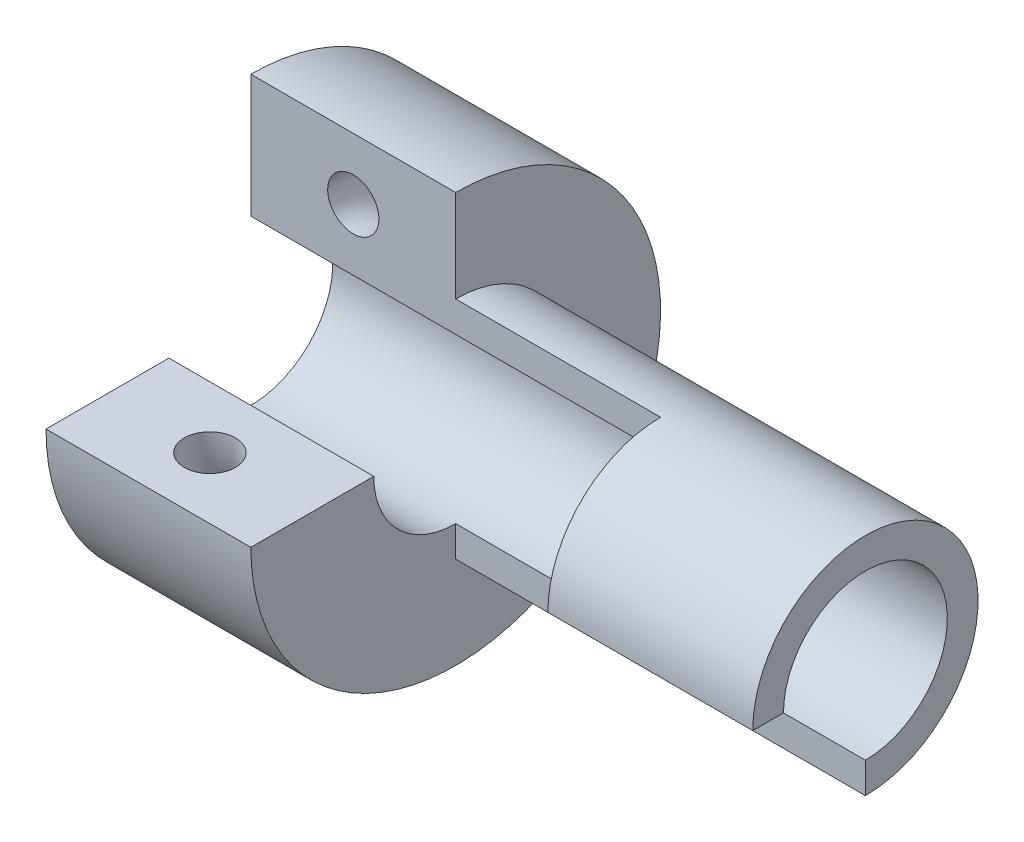
ISO-10303-21;
HEADER;
FILE_DESCRIPTION(('STEP AP214'),'2;1');
FILE_NAME('part.step','',(''),(''),'','','');
FILE_SCHEMA(('AUTOMOTIVE_DESIGN { 1 0 10303 214 1 1 1 1 }'));
ENDSEC;
DATA;
#1=APPLICATION_CONTEXT('core data for automotive mechanical design processes');
#2=APPLICATION_PROTOCOL_DEFINITION('international standard','automotive_design',2000,#1);
#3=PRODUCT_CONTEXT('',#1,'mechanical');
#4=PRODUCT('Part','Part','',(#3));
#5=PRODUCT_RELATED_PRODUCT_CATEGORY('part','',(#4));
#6=PRODUCT_DEFINITION_FORMATION('','',#4);
#7=PRODUCT_DEFINITION_CONTEXT('part definition',#1,'design');
#8=PRODUCT_DEFINITION('design','',#6,#7);
#9=PRODUCT_DEFINITION_SHAPE('','',#8);
#10=(LENGTH_UNIT() NAMED_UNIT(*) SI_UNIT(.MILLI.,.METRE.));
#11=(NAMED_UNIT(*) PLANE_ANGLE_UNIT() SI_UNIT($,.RADIAN.));
#12=(NAMED_UNIT(*) SI_UNIT($,.STERADIAN.) SOLID_ANGLE_UNIT());
#13=UNCERTAINTY_MEASURE_WITH_UNIT(LENGTH_MEASURE(1.E-05),#10,'distance_accuracy_value','');
#14=(GEOMETRIC_REPRESENTATION_CONTEXT(3) GLOBAL_UNCERTAINTY_ASSIGNED_CONTEXT((#13)) GLOBAL_UNIT_ASSIGNED_CONTEXT((#10,
#11,#12)) REPRESENTATION_CONTEXT('',''));
#15=CARTESIAN_POINT('',(0.,0.,0.));
#16=DIRECTION('',(0.,0.,1.));
#17=DIRECTION('',(1.,0.,0.));
#18=AXIS2_PLACEMENT_3D('',#15,#16,#17);
#19=CARTESIAN_POINT('',(0.,20.,-19.9999999999998));
#20=DIRECTION('',(0.,0.,-1.));
#21=DIRECTION('',(0.,1.,0.));
#22=AXIS2_PLACEMENT_3D('',#19,#20,#21);
#23=PLANE('',#22);
#24=CARTESIAN_POINT('',(10.,14.,-19.9999999999996));
#25=DIRECTION('',(0.,0.,-1.));
#26=DIRECTION('',(0.,1.,0.));
#27=AXIS2_PLACEMENT_3D('',#24,#25,#26);
#28=CIRCLE('',#27,2.5);
#29=CARTESIAN_POINT('',(10.,16.5,-19.9999999999995));
#30=VERTEX_POINT('',#29);
#31=EDGE_CURVE('E140',#30,#30,#28,.T.);
#32=ORIENTED_EDGE('',*,*,#31,.T.);
#33=EDGE_LOOP('',(#32));
#34=FACE_BOUND('',#33,.T.);
#35=DIRECTION('',(0.,-1.,0.));
#36=VECTOR('',#35,1.);
#37=CARTESIAN_POINT('',(40.,11.,-20.));
#38=LINE('',#37,#36);
#39=CARTESIAN_POINT('',(40.,11.,-20.));
#40=VERTEX_POINT('',#39);
#41=CARTESIAN_POINT('',(40.,8.,-20.));
#42=VERTEX_POINT('',#41);
#43=EDGE_CURVE('E114',#40,#42,#38,.T.);
#44=ORIENTED_EDGE('',*,*,#43,.F.);
#45=DIRECTION('',(-1.,0.,0.));
#46=VECTOR('',#45,1.);
#47=CARTESIAN_POINT('',(60.,11.,-19.9999999999998));
#48=LINE('',#47,#46);
#49=CARTESIAN_POINT('',(20.,11.,-19.9999999999999));
#50=VERTEX_POINT('',#49);
#51=EDGE_CURVE('E63',#40,#50,#48,.T.);
#52=ORIENTED_EDGE('',*,*,#51,.T.);
#53=DIRECTION('',(0.,-1.,0.));
#54=VECTOR('',#53,1.);
#55=CARTESIAN_POINT('',(20.,20.,-19.9999999999998));
#56=LINE('',#55,#54);
#57=CARTESIAN_POINT('',(20.,20.,-19.9999999999998));
#58=VERTEX_POINT('',#57);
#59=EDGE_CURVE('E176',#58,#50,#56,.T.);
#60=ORIENTED_EDGE('',*,*,#59,.F.);
#61=DIRECTION('',(1.,0.,0.));
#62=VECTOR('',#61,1.);
#63=CARTESIAN_POINT('',(0.,20.,-19.9999999999998));
#64=LINE('',#63,#62);
#65=CARTESIAN_POINT('',(0.,20.,-19.9999999999998));
#66=VERTEX_POINT('',#65);
#67=EDGE_CURVE('E172',#66,#58,#64,.T.);
#68=ORIENTED_EDGE('',*,*,#67,.F.);
#69=DIRECTION('',(0.,1.,0.));
#70=VECTOR('',#69,1.);
#71=CARTESIAN_POINT('',(0.,8.,-19.9999999999999));
#72=LINE('',#71,#70);
#73=CARTESIAN_POINT('',(0.,8.,-19.9999999999999));
#74=VERTEX_POINT('',#73);
#75=EDGE_CURVE('E168',#74,#66,#72,.T.);
#76=ORIENTED_EDGE('',*,*,#75,.F.);
#77=DIRECTION('',(-1.,0.,0.));
#78=VECTOR('',#77,1.);
#79=CARTESIAN_POINT('',(20.,8.,-19.9999999999999));
#80=LINE('',#79,#78);
#81=EDGE_CURVE('E126',#42,#74,#80,.T.);
#82=ORIENTED_EDGE('',*,*,#81,.F.);
#83=EDGE_LOOP('',(#44,#52,#60,#68,#76,#82));
#84=FACE_BOUND('',#83,.T.);
#85=ADVANCED_FACE('F39',(#34,#84),#23,.F.);
#86=CARTESIAN_POINT('',(0.,0.,-20.));
#87=DIRECTION('',(-1.,0.,0.));
#88=DIRECTION('',(0.,0.,1.));
#89=AXIS2_PLACEMENT_3D('',#86,#87,#88);
#90=CYLINDRICAL_SURFACE('',#89,8.);
#91=CARTESIAN_POINT('',(0.,0.,-20.));
#92=DIRECTION('',(-1.,0.,0.));
#93=DIRECTION('',(0.,0.,1.));
#94=AXIS2_PLACEMENT_3D('',#91,#92,#93);
#95=CIRCLE('',#94,8.);
#96=CARTESIAN_POINT('',(0.,0.,-12.));
#97=VERTEX_POINT('',#96);
#98=EDGE_CURVE('E11',#74,#97,#95,.T.);
#99=ORIENTED_EDGE('',*,*,#98,.T.);
#100=DIRECTION('',(-1.,0.,0.));
#101=VECTOR('',#100,1.);
#102=CARTESIAN_POINT('',(20.,0.,-12.));
#103=LINE('',#102,#101);
#104=CARTESIAN_POINT('',(20.,0.,-12.));
#105=VERTEX_POINT('',#104);
#106=EDGE_CURVE('E150',#105,#97,#103,.T.);
#107=ORIENTED_EDGE('',*,*,#106,.F.);
#108=CARTESIAN_POINT('',(20.,0.,-20.));
#109=DIRECTION('',(-1.,0.,0.));
#110=DIRECTION('',(0.,0.,1.));
#111=AXIS2_PLACEMENT_3D('',#108,#109,#110);
#112=CIRCLE('',#111,8.);
#113=CARTESIAN_POINT('',(20.,-8.,-20.0000000000001));
#114=VERTEX_POINT('',#113);
#115=EDGE_CURVE('E179',#114,#105,#112,.T.);
#116=ORIENTED_EDGE('',*,*,#115,.F.);
#117=DIRECTION('',(-1.,0.,0.));
#118=VECTOR('',#117,1.);
#119=CARTESIAN_POINT('',(60.,-8.,-20.));
#120=LINE('',#119,#118);
#121=CARTESIAN_POINT('',(60.,-8.,-20.));
#122=VERTEX_POINT('',#121);
#123=EDGE_CURVE('E135',#122,#114,#120,.T.);
#124=ORIENTED_EDGE('',*,*,#123,.F.);
#125=CARTESIAN_POINT('',(60.,0.,-20.));
#126=DIRECTION('',(-1.,0.,0.));
#127=DIRECTION('',(0.,0.,1.));
#128=AXIS2_PLACEMENT_3D('',#125,#126,#127);
#129=CIRCLE('',#128,8.);
#130=CARTESIAN_POINT('',(60.,0.,-12.));
#131=VERTEX_POINT('',#130);
#132=EDGE_CURVE('E214',#131,#122,#129,.T.);
#133=ORIENTED_EDGE('',*,*,#132,.F.);
#134=DIRECTION('',(1.,0.,0.));
#135=VECTOR('',#134,1.);
#136=CARTESIAN_POINT('',(40.,0.,-12.));
#137=LINE('',#136,#135);
#138=CARTESIAN_POINT('',(40.,0.,-12.));
#139=VERTEX_POINT('',#138);
#140=EDGE_CURVE('E202',#139,#131,#137,.T.);
#141=ORIENTED_EDGE('',*,*,#140,.F.);
#142=CARTESIAN_POINT('',(40.,0.,-20.));
#143=DIRECTION('',(-1.,0.,0.));
#144=DIRECTION('',(0.,0.,1.));
#145=AXIS2_PLACEMENT_3D('',#142,#143,#144);
#146=CIRCLE('',#145,8.);
#147=EDGE_CURVE('E123',#139,#42,#146,.T.);
#148=ORIENTED_EDGE('',*,*,#147,.T.);
#149=ORIENTED_EDGE('',*,*,#81,.T.);
#150=EDGE_LOOP('',(#99,#107,#116,#124,#133,#141,#148,#149));
#151=FACE_BOUND('',#150,.T.);
#152=ADVANCED_FACE('F199',(#151),#90,.F.);
#153=CARTESIAN_POINT('',(0.,8.,-19.9999999999999));
#154=DIRECTION('',(-1.,0.,0.));
#155=DIRECTION('',(0.,0.,1.));
#156=AXIS2_PLACEMENT_3D('',#153,#154,#155);
#157=PLANE('',#156);
#158=CARTESIAN_POINT('',(0.,0.,-20.));
#159=DIRECTION('',(-1.,0.,0.));
#160=DIRECTION('',(0.,0.,1.));
#161=AXIS2_PLACEMENT_3D('',#158,#159,#160);
#162=CIRCLE('',#161,20.);
#163=CARTESIAN_POINT('',(0.,0.,0.));
#164=VERTEX_POINT('',#163);
#165=EDGE_CURVE('E48',#66,#164,#162,.T.);
#166=ORIENTED_EDGE('',*,*,#165,.T.);
#167=DIRECTION('',(0.,0.,1.));
#168=VECTOR('',#167,1.);
#169=CARTESIAN_POINT('',(0.,0.,-12.));
#170=LINE('',#169,#168);
#171=EDGE_CURVE('E154',#97,#164,#170,.T.);
#172=ORIENTED_EDGE('',*,*,#171,.F.);
#173=ORIENTED_EDGE('',*,*,#98,.F.);
#174=ORIENTED_EDGE('',*,*,#75,.T.);
#175=EDGE_LOOP('',(#166,#172,#173,#174));
#176=FACE_BOUND('',#175,.T.);
#177=ADVANCED_FACE('F41',(#176),#157,.T.);
#178=CARTESIAN_POINT('',(0.,0.,-20.));
#179=DIRECTION('',(-1.,0.,0.));
#180=DIRECTION('',(0.,0.,1.));
#181=AXIS2_PLACEMENT_3D('',#178,#179,#180);
#182=CYLINDRICAL_SURFACE('',#181,20.);
#183=CARTESIAN_POINT('',(20.,0.,-20.));
#184=DIRECTION('',(-1.,0.,0.));
#185=DIRECTION('',(0.,0.,1.));
#186=AXIS2_PLACEMENT_3D('',#183,#184,#185);
#187=CIRCLE('',#186,20.);
#188=CARTESIAN_POINT('',(20.,0.,0.));
#189=VERTEX_POINT('',#188);
#190=EDGE_CURVE('E182',#58,#189,#187,.T.);
#191=ORIENTED_EDGE('',*,*,#190,.T.);
#192=DIRECTION('',(1.,0.,0.));
#193=VECTOR('',#192,1.);
#194=CARTESIAN_POINT('',(0.,0.,0.));
#195=LINE('',#194,#193);
#196=EDGE_CURVE('E158',#164,#189,#195,.T.);
#197=ORIENTED_EDGE('',*,*,#196,.F.);
#198=ORIENTED_EDGE('',*,*,#165,.F.);
#199=ORIENTED_EDGE('',*,*,#67,.T.);
#200=EDGE_LOOP('',(#191,#197,#198,#199));
#201=FACE_BOUND('',#200,.T.);
#202=ADVANCED_FACE('F195',(#201),#182,.T.);
#203=CARTESIAN_POINT('',(20.,20.,-19.9999999999998));
#204=DIRECTION('',(1.,0.,0.));
#205=DIRECTION('',(0.,0.,-1.));
#206=AXIS2_PLACEMENT_3D('',#203,#204,#205);
#207=PLANE('',#206);
#208=CARTESIAN_POINT('',(20.,0.,-20.));
#209=DIRECTION('',(1.,0.,0.));
#210=DIRECTION('',(0.,0.,1.));
#211=AXIS2_PLACEMENT_3D('',#208,#209,#210);
#212=CIRCLE('',#211,11.);
#213=CARTESIAN_POINT('',(20.,-11.,-20.0000000000001));
#214=VERTEX_POINT('',#213);
#215=EDGE_CURVE('E122',#214,#50,#212,.T.);
#216=ORIENTED_EDGE('',*,*,#215,.F.);
#217=DIRECTION('',(0.,-1.,0.));
#218=VECTOR('',#217,1.);
#219=CARTESIAN_POINT('',(20.,-11.,-20.0000000000001));
#220=LINE('',#219,#218);
#221=EDGE_CURVE('E55',#114,#214,#220,.T.);
#222=ORIENTED_EDGE('',*,*,#221,.F.);
#223=ORIENTED_EDGE('',*,*,#115,.T.);
#224=DIRECTION('',(0.,0.,-1.));
#225=VECTOR('',#224,1.);
#226=CARTESIAN_POINT('',(20.,0.,0.));
#227=LINE('',#226,#225);
#228=EDGE_CURVE('E162',#189,#105,#227,.T.);
#229=ORIENTED_EDGE('',*,*,#228,.F.);
#230=ORIENTED_EDGE('',*,*,#190,.F.);
#231=ORIENTED_EDGE('',*,*,#59,.T.);
#232=EDGE_LOOP('',(#216,#222,#223,#229,#230,#231));
#233=FACE_BOUND('',#232,.T.);
#234=ADVANCED_FACE('F196',(#233),#207,.T.);
#235=CARTESIAN_POINT('',(0.,0.,0.));
#236=DIRECTION('',(0.,1.,0.));
#237=DIRECTION('',(0.,0.,1.));
#238=AXIS2_PLACEMENT_3D('',#235,#236,#237);
#239=PLANE('',#238);
#240=CARTESIAN_POINT('',(10.,0.,-6.));
#241=DIRECTION('',(0.,1.,0.));
#242=DIRECTION('',(0.,0.,1.));
#243=AXIS2_PLACEMENT_3D('',#240,#241,#242);
#244=CIRCLE('',#243,2.5);
#245=CARTESIAN_POINT('',(10.,0.,-3.5));
#246=VERTEX_POINT('',#245);
#247=EDGE_CURVE('E134',#246,#246,#244,.T.);
#248=ORIENTED_EDGE('',*,*,#247,.F.);
#249=EDGE_LOOP('',(#248));
#250=FACE_BOUND('',#249,.T.);
#251=ORIENTED_EDGE('',*,*,#106,.T.);
#252=ORIENTED_EDGE('',*,*,#171,.T.);
#253=ORIENTED_EDGE('',*,*,#196,.T.);
#254=ORIENTED_EDGE('',*,*,#228,.T.);
#255=EDGE_LOOP('',(#251,#252,#253,#254));
#256=FACE_BOUND('',#255,.T.);
#257=ADVANCED_FACE('F192',(#250,#256),#239,.T.);
#258=CARTESIAN_POINT('',(10.,0.,-20.));
#259=DIRECTION('',(-1.,0.,0.));
#260=DIRECTION('',(0.,0.,1.));
#261=AXIS2_PLACEMENT_3D('',#258,#259,#260);
#262=TOROIDAL_SURFACE('',#261,14.,2.5);
#263=CARTESIAN_POINT('',(10.,0.,-20.));
#264=DIRECTION('',(-1.,0.,0.));
#265=DIRECTION('',(0.,0.,1.));
#266=AXIS2_PLACEMENT_3D('',#263,#264,#265);
#267=CIRCLE('',#266,16.5);
#268=EDGE_CURVE('',#30,#246,#267,.T.);
#269=ORIENTED_EDGE('',*,*,#31,.F.);
#270=ORIENTED_EDGE('',*,*,#247,.T.);
#271=ORIENTED_EDGE('',*,*,#268,.T.);
#272=ORIENTED_EDGE('',*,*,#268,.F.);
#273=EDGE_LOOP('',(#269,#271,#270,#272));
#274=FACE_BOUND('',#273,.T.);
#275=ADVANCED_FACE('F280',(#274),#262,.F.);
#276=CARTESIAN_POINT('',(60.,0.,-20.));
#277=DIRECTION('',(-1.,0.,0.));
#278=DIRECTION('',(0.,0.,1.));
#279=AXIS2_PLACEMENT_3D('',#276,#277,#278);
#280=CYLINDRICAL_SURFACE('',#279,11.);
#281=ORIENTED_EDGE('',*,*,#215,.T.);
#282=ORIENTED_EDGE('',*,*,#51,.F.);
#283=CARTESIAN_POINT('',(40.,0.,-20.));
#284=DIRECTION('',(-1.,0.,0.));
#285=DIRECTION('',(0.,0.,1.));
#286=AXIS2_PLACEMENT_3D('',#283,#284,#285);
#287=CIRCLE('',#286,11.);
#288=CARTESIAN_POINT('',(40.,0.,-9.));
#289=VERTEX_POINT('',#288);
#290=EDGE_CURVE('E112',#289,#40,#287,.T.);
#291=ORIENTED_EDGE('',*,*,#290,.F.);
#292=DIRECTION('',(-1.,0.,0.));
#293=VECTOR('',#292,1.);
#294=CARTESIAN_POINT('',(60.,0.,-9.));
#295=LINE('',#294,#293);
#296=CARTESIAN_POINT('',(60.,0.,-9.));
#297=VERTEX_POINT('',#296);
#298=EDGE_CURVE('E128',#297,#289,#295,.T.);
#299=ORIENTED_EDGE('',*,*,#298,.F.);
#300=CARTESIAN_POINT('',(60.,0.,-20.));
#301=DIRECTION('',(1.,0.,0.));
#302=DIRECTION('',(0.,0.,1.));
#303=AXIS2_PLACEMENT_3D('',#300,#301,#302);
#304=CIRCLE('',#303,11.);
#305=CARTESIAN_POINT('',(60.,-11.,-20.0000000000001));
#306=VERTEX_POINT('',#305);
#307=EDGE_CURVE('E211',#306,#297,#304,.T.);
#308=ORIENTED_EDGE('',*,*,#307,.F.);
#309=DIRECTION('',(-1.,0.,0.));
#310=VECTOR('',#309,1.);
#311=CARTESIAN_POINT('',(60.,-11.,-20.0000000000001));
#312=LINE('',#311,#310);
#313=EDGE_CURVE('E143',#306,#214,#312,.T.);
#314=ORIENTED_EDGE('',*,*,#313,.T.);
#315=EDGE_LOOP('',(#281,#282,#291,#299,#308,#314));
#316=FACE_BOUND('',#315,.T.);
#317=ADVANCED_FACE('F131',(#316),#280,.T.);
#318=CARTESIAN_POINT('',(60.,-11.,-20.0000000000001));
#319=DIRECTION('',(0.,0.,-1.));
#320=DIRECTION('',(0.,1.,0.));
#321=AXIS2_PLACEMENT_3D('',#318,#319,#320);
#322=PLANE('',#321);
#323=ORIENTED_EDGE('',*,*,#221,.T.);
#324=ORIENTED_EDGE('',*,*,#313,.F.);
#325=DIRECTION('',(0.,-1.,0.));
#326=VECTOR('',#325,1.);
#327=CARTESIAN_POINT('',(60.,-11.,-20.0000000000001));
#328=LINE('',#327,#326);
#329=EDGE_CURVE('E217',#122,#306,#328,.T.);
#330=ORIENTED_EDGE('',*,*,#329,.F.);
#331=ORIENTED_EDGE('',*,*,#123,.T.);
#332=EDGE_LOOP('',(#323,#324,#330,#331));
#333=FACE_BOUND('',#332,.T.);
#334=ADVANCED_FACE('F228',(#333),#322,.F.);
#335=CARTESIAN_POINT('',(60.,0.,-20.));
#336=DIRECTION('',(-1.,0.,0.));
#337=DIRECTION('',(0.,0.,1.));
#338=AXIS2_PLACEMENT_3D('',#335,#336,#337);
#339=PLANE('',#338);
#340=ORIENTED_EDGE('',*,*,#307,.T.);
#341=DIRECTION('',(0.,0.,1.));
#342=VECTOR('',#341,1.);
#343=CARTESIAN_POINT('',(60.,0.,-12.));
#344=LINE('',#343,#342);
#345=EDGE_CURVE('E204',#131,#297,#344,.T.);
#346=ORIENTED_EDGE('',*,*,#345,.F.);
#347=ORIENTED_EDGE('',*,*,#132,.T.);
#348=ORIENTED_EDGE('',*,*,#329,.T.);
#349=EDGE_LOOP('',(#340,#346,#347,#348));
#350=FACE_BOUND('',#349,.T.);
#351=ADVANCED_FACE('F234',(#350),#339,.F.);
#352=CARTESIAN_POINT('',(40.,0.,-9.));
#353=DIRECTION('',(1.,0.,0.));
#354=DIRECTION('',(0.,0.,-1.));
#355=AXIS2_PLACEMENT_3D('',#352,#353,#354);
#356=PLANE('',#355);
#357=ORIENTED_EDGE('',*,*,#147,.F.);
#358=DIRECTION('',(0.,0.,-1.));
#359=VECTOR('',#358,1.);
#360=CARTESIAN_POINT('',(40.,0.,-9.));
#361=LINE('',#360,#359);
#362=EDGE_CURVE('E117',#289,#139,#361,.T.);
#363=ORIENTED_EDGE('',*,*,#362,.F.);
#364=ORIENTED_EDGE('',*,*,#290,.T.);
#365=ORIENTED_EDGE('',*,*,#43,.T.);
#366=EDGE_LOOP('',(#357,#363,#364,#365));
#367=FACE_BOUND('',#366,.T.);
#368=ADVANCED_FACE('F113',(#367),#356,.F.);
#369=CARTESIAN_POINT('',(0.,0.,-20.));
#370=DIRECTION('',(0.,-1.,0.));
#371=DIRECTION('',(1.,0.,0.));
#372=AXIS2_PLACEMENT_3D('',#369,#370,#371);
#373=PLANE('',#372);
#374=ORIENTED_EDGE('',*,*,#298,.T.);
#375=ORIENTED_EDGE('',*,*,#362,.T.);
#376=ORIENTED_EDGE('',*,*,#140,.T.);
#377=ORIENTED_EDGE('',*,*,#345,.T.);
#378=EDGE_LOOP('',(#374,#375,#376,#377));
#379=FACE_BOUND('',#378,.T.);
#380=ADVANCED_FACE('F232',(#379),#373,.T.);
#381=CLOSED_SHELL('',(#85,#152,#177,#202,#234,#257,#275,#317,#334,#351,#368,#380));
#382=MANIFOLD_SOLID_BREP('B2',#381);
#383=ADVANCED_BREP_SHAPE_REPRESENTATION('',(#18,#382),#14);
#384=SHAPE_DEFINITION_REPRESENTATION(#9,#383);
ENDSEC;
END-ISO-10303-21;
